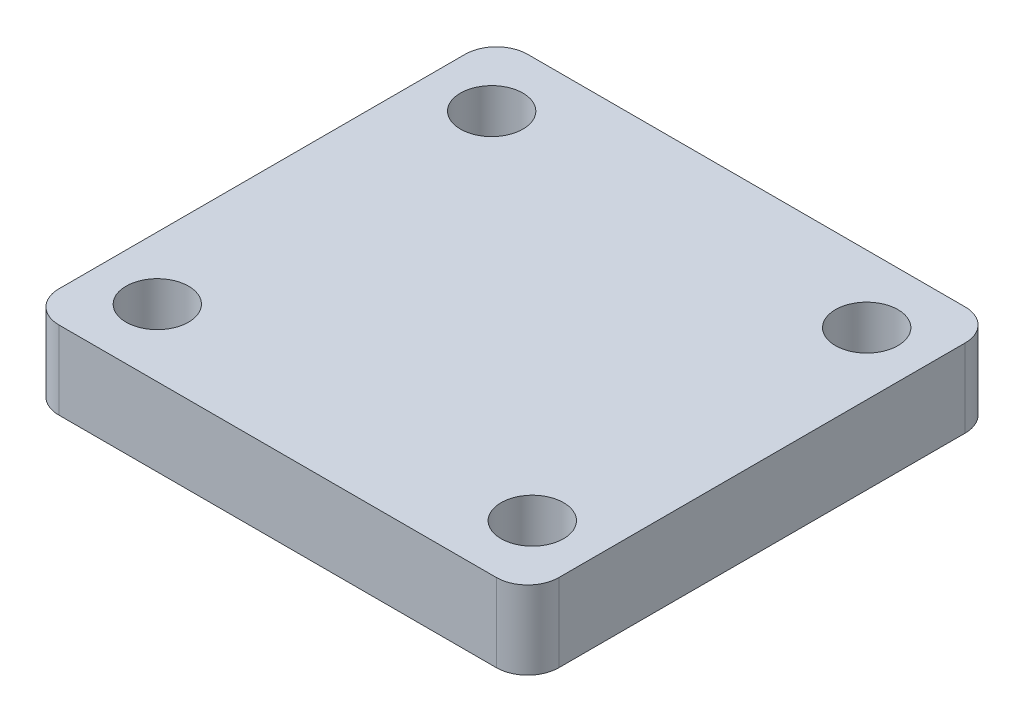
ISO-10303-21;
HEADER;
FILE_DESCRIPTION(('STEP AP214'),'2;1');
FILE_NAME('part.step','',(''),(''),'','','');
FILE_SCHEMA(('AUTOMOTIVE_DESIGN { 1 0 10303 214 1 1 1 1 }'));
ENDSEC;
DATA;
#1=APPLICATION_CONTEXT('core data for automotive mechanical design processes');
#2=APPLICATION_PROTOCOL_DEFINITION('international standard','automotive_design',2000,#1);
#3=PRODUCT_CONTEXT('',#1,'mechanical');
#4=PRODUCT('Part','Part','',(#3));
#5=PRODUCT_RELATED_PRODUCT_CATEGORY('part','',(#4));
#6=PRODUCT_DEFINITION_FORMATION('','',#4);
#7=PRODUCT_DEFINITION_CONTEXT('part definition',#1,'design');
#8=PRODUCT_DEFINITION('design','',#6,#7);
#9=PRODUCT_DEFINITION_SHAPE('','',#8);
#10=(LENGTH_UNIT() NAMED_UNIT(*) SI_UNIT(.MILLI.,.METRE.));
#11=(NAMED_UNIT(*) PLANE_ANGLE_UNIT() SI_UNIT($,.RADIAN.));
#12=(NAMED_UNIT(*) SI_UNIT($,.STERADIAN.) SOLID_ANGLE_UNIT());
#13=UNCERTAINTY_MEASURE_WITH_UNIT(LENGTH_MEASURE(1.E-05),#10,'distance_accuracy_value','');
#14=(GEOMETRIC_REPRESENTATION_CONTEXT(3) GLOBAL_UNCERTAINTY_ASSIGNED_CONTEXT((#13)) GLOBAL_UNIT_ASSIGNED_CONTEXT((#10,
#11,#12)) REPRESENTATION_CONTEXT('',''));
#15=CARTESIAN_POINT('',(0.,0.,0.));
#16=DIRECTION('',(0.,0.,1.));
#17=DIRECTION('',(1.,0.,0.));
#18=AXIS2_PLACEMENT_3D('',#15,#16,#17);
#19=CARTESIAN_POINT('',(-14.,5.,13.));
#20=DIRECTION('',(0.,-1.,0.));
#21=DIRECTION('',(0.,0.,-1.));
#22=AXIS2_PLACEMENT_3D('',#19,#20,#21);
#23=CYLINDRICAL_SURFACE('',#22,2.);
#24=CARTESIAN_POINT('',(-14.,0.,13.));
#25=DIRECTION('',(0.,1.,0.));
#26=DIRECTION('',(0.,0.,1.));
#27=AXIS2_PLACEMENT_3D('',#24,#25,#26);
#28=CIRCLE('',#27,2.);
#29=CARTESIAN_POINT('',(-16.,0.,13.));
#30=VERTEX_POINT('',#29);
#31=CARTESIAN_POINT('',(-14.,0.,15.));
#32=VERTEX_POINT('',#31);
#33=EDGE_CURVE('E128',#30,#32,#28,.T.);
#34=ORIENTED_EDGE('',*,*,#33,.T.);
#35=DIRECTION('',(0.,-1.,0.));
#36=VECTOR('',#35,1.);
#37=CARTESIAN_POINT('',(-14.,5.,15.));
#38=LINE('',#37,#36);
#39=CARTESIAN_POINT('',(-14.,5.,15.));
#40=VERTEX_POINT('',#39);
#41=EDGE_CURVE('E11',#40,#32,#38,.T.);
#42=ORIENTED_EDGE('',*,*,#41,.F.);
#43=CARTESIAN_POINT('',(-14.,5.,13.));
#44=DIRECTION('',(0.,1.,0.));
#45=DIRECTION('',(0.,0.,1.));
#46=AXIS2_PLACEMENT_3D('',#43,#44,#45);
#47=CIRCLE('',#46,2.);
#48=CARTESIAN_POINT('',(-16.,5.,13.));
#49=VERTEX_POINT('',#48);
#50=EDGE_CURVE('E143',#49,#40,#47,.T.);
#51=ORIENTED_EDGE('',*,*,#50,.F.);
#52=DIRECTION('',(0.,-1.,0.));
#53=VECTOR('',#52,1.);
#54=CARTESIAN_POINT('',(-16.,5.,13.));
#55=LINE('',#54,#53);
#56=EDGE_CURVE('E124',#49,#30,#55,.T.);
#57=ORIENTED_EDGE('',*,*,#56,.T.);
#58=EDGE_LOOP('',(#34,#42,#51,#57));
#59=FACE_BOUND('',#58,.T.);
#60=ADVANCED_FACE('F32',(#59),#23,.T.);
#61=CARTESIAN_POINT('',(14.,5.,15.));
#62=DIRECTION('',(0.,0.,-1.));
#63=DIRECTION('',(-1.,0.,0.));
#64=AXIS2_PLACEMENT_3D('',#61,#62,#63);
#65=PLANE('',#64);
#66=DIRECTION('',(1.,0.,0.));
#67=VECTOR('',#66,1.);
#68=CARTESIAN_POINT('',(14.,0.,15.));
#69=LINE('',#68,#67);
#70=CARTESIAN_POINT('',(14.,0.,15.));
#71=VERTEX_POINT('',#70);
#72=EDGE_CURVE('E131',#32,#71,#69,.T.);
#73=ORIENTED_EDGE('',*,*,#72,.T.);
#74=DIRECTION('',(0.,-1.,0.));
#75=VECTOR('',#74,1.);
#76=CARTESIAN_POINT('',(14.,5.,15.));
#77=LINE('',#76,#75);
#78=CARTESIAN_POINT('',(14.,5.,15.));
#79=VERTEX_POINT('',#78);
#80=EDGE_CURVE('E40',#79,#71,#77,.T.);
#81=ORIENTED_EDGE('',*,*,#80,.F.);
#82=DIRECTION('',(1.,0.,0.));
#83=VECTOR('',#82,1.);
#84=CARTESIAN_POINT('',(14.,5.,15.));
#85=LINE('',#84,#83);
#86=EDGE_CURVE('E91',#40,#79,#85,.T.);
#87=ORIENTED_EDGE('',*,*,#86,.F.);
#88=ORIENTED_EDGE('',*,*,#41,.T.);
#89=EDGE_LOOP('',(#73,#81,#87,#88));
#90=FACE_BOUND('',#89,.T.);
#91=ADVANCED_FACE('F228',(#90),#65,.F.);
#92=CARTESIAN_POINT('',(14.,5.,13.));
#93=DIRECTION('',(0.,-1.,0.));
#94=DIRECTION('',(0.,0.,-1.));
#95=AXIS2_PLACEMENT_3D('',#92,#93,#94);
#96=CYLINDRICAL_SURFACE('',#95,2.);
#97=CARTESIAN_POINT('',(14.,0.,13.));
#98=DIRECTION('',(0.,1.,0.));
#99=DIRECTION('',(0.,0.,-1.));
#100=AXIS2_PLACEMENT_3D('',#97,#98,#99);
#101=CIRCLE('',#100,2.);
#102=CARTESIAN_POINT('',(16.,0.,13.));
#103=VERTEX_POINT('',#102);
#104=EDGE_CURVE('E134',#71,#103,#101,.T.);
#105=ORIENTED_EDGE('',*,*,#104,.T.);
#106=DIRECTION('',(0.,-1.,0.));
#107=VECTOR('',#106,1.);
#108=CARTESIAN_POINT('',(16.,5.,13.));
#109=LINE('',#108,#107);
#110=CARTESIAN_POINT('',(16.,5.,13.));
#111=VERTEX_POINT('',#110);
#112=EDGE_CURVE('E150',#111,#103,#109,.T.);
#113=ORIENTED_EDGE('',*,*,#112,.F.);
#114=CARTESIAN_POINT('',(14.,5.,13.));
#115=DIRECTION('',(0.,1.,0.));
#116=DIRECTION('',(0.,0.,-1.));
#117=AXIS2_PLACEMENT_3D('',#114,#115,#116);
#118=CIRCLE('',#117,2.);
#119=EDGE_CURVE('E158',#79,#111,#118,.T.);
#120=ORIENTED_EDGE('',*,*,#119,.F.);
#121=ORIENTED_EDGE('',*,*,#80,.T.);
#122=EDGE_LOOP('',(#105,#113,#120,#121));
#123=FACE_BOUND('',#122,.T.);
#124=ADVANCED_FACE('F156',(#123),#96,.T.);
#125=CARTESIAN_POINT('',(16.,5.,13.));
#126=DIRECTION('',(-1.,0.,0.));
#127=DIRECTION('',(0.,0.,1.));
#128=AXIS2_PLACEMENT_3D('',#125,#126,#127);
#129=PLANE('',#128);
#130=DIRECTION('',(0.,0.,-1.));
#131=VECTOR('',#130,1.);
#132=CARTESIAN_POINT('',(16.,0.,13.));
#133=LINE('',#132,#131);
#134=CARTESIAN_POINT('',(16.,0.,-13.));
#135=VERTEX_POINT('',#134);
#136=EDGE_CURVE('E136',#103,#135,#133,.T.);
#137=ORIENTED_EDGE('',*,*,#136,.T.);
#138=DIRECTION('',(0.,-1.,0.));
#139=VECTOR('',#138,1.);
#140=CARTESIAN_POINT('',(16.,5.,-13.));
#141=LINE('',#140,#139);
#142=CARTESIAN_POINT('',(16.,5.,-13.));
#143=VERTEX_POINT('',#142);
#144=EDGE_CURVE('E147',#143,#135,#141,.T.);
#145=ORIENTED_EDGE('',*,*,#144,.F.);
#146=DIRECTION('',(0.,0.,-1.));
#147=VECTOR('',#146,1.);
#148=CARTESIAN_POINT('',(16.,5.,13.));
#149=LINE('',#148,#147);
#150=EDGE_CURVE('E170',#111,#143,#149,.T.);
#151=ORIENTED_EDGE('',*,*,#150,.F.);
#152=ORIENTED_EDGE('',*,*,#112,.T.);
#153=EDGE_LOOP('',(#137,#145,#151,#152));
#154=FACE_BOUND('',#153,.T.);
#155=ADVANCED_FACE('F166',(#154),#129,.F.);
#156=CARTESIAN_POINT('',(14.,5.,-13.));
#157=DIRECTION('',(0.,-1.,0.));
#158=DIRECTION('',(0.,0.,-1.));
#159=AXIS2_PLACEMENT_3D('',#156,#157,#158);
#160=CYLINDRICAL_SURFACE('',#159,2.);
#161=CARTESIAN_POINT('',(14.,0.,-13.));
#162=DIRECTION('',(0.,1.,0.));
#163=DIRECTION('',(0.,0.,1.));
#164=AXIS2_PLACEMENT_3D('',#161,#162,#163);
#165=CIRCLE('',#164,2.);
#166=CARTESIAN_POINT('',(14.,0.,-15.));
#167=VERTEX_POINT('',#166);
#168=EDGE_CURVE('E138',#135,#167,#165,.T.);
#169=ORIENTED_EDGE('',*,*,#168,.T.);
#170=DIRECTION('',(0.,-1.,0.));
#171=VECTOR('',#170,1.);
#172=CARTESIAN_POINT('',(14.,5.,-15.));
#173=LINE('',#172,#171);
#174=CARTESIAN_POINT('',(14.,5.,-15.));
#175=VERTEX_POINT('',#174);
#176=EDGE_CURVE('E119',#175,#167,#173,.T.);
#177=ORIENTED_EDGE('',*,*,#176,.F.);
#178=CARTESIAN_POINT('',(14.,5.,-13.));
#179=DIRECTION('',(0.,1.,0.));
#180=DIRECTION('',(0.,0.,1.));
#181=AXIS2_PLACEMENT_3D('',#178,#179,#180);
#182=CIRCLE('',#181,2.);
#183=EDGE_CURVE('E110',#143,#175,#182,.T.);
#184=ORIENTED_EDGE('',*,*,#183,.F.);
#185=ORIENTED_EDGE('',*,*,#144,.T.);
#186=EDGE_LOOP('',(#169,#177,#184,#185));
#187=FACE_BOUND('',#186,.T.);
#188=ADVANCED_FACE('F169',(#187),#160,.T.);
#189=CARTESIAN_POINT('',(14.,5.,-15.));
#190=DIRECTION('',(0.,0.,1.));
#191=DIRECTION('',(1.,0.,0.));
#192=AXIS2_PLACEMENT_3D('',#189,#190,#191);
#193=PLANE('',#192);
#194=DIRECTION('',(-1.,0.,0.));
#195=VECTOR('',#194,1.);
#196=CARTESIAN_POINT('',(14.,0.,-15.));
#197=LINE('',#196,#195);
#198=CARTESIAN_POINT('',(-14.,0.,-15.));
#199=VERTEX_POINT('',#198);
#200=EDGE_CURVE('E118',#167,#199,#197,.T.);
#201=ORIENTED_EDGE('',*,*,#200,.T.);
#202=DIRECTION('',(0.,-1.,0.));
#203=VECTOR('',#202,1.);
#204=CARTESIAN_POINT('',(-14.,5.,-15.));
#205=LINE('',#204,#203);
#206=CARTESIAN_POINT('',(-14.,5.,-15.));
#207=VERTEX_POINT('',#206);
#208=EDGE_CURVE('E115',#207,#199,#205,.T.);
#209=ORIENTED_EDGE('',*,*,#208,.F.);
#210=DIRECTION('',(-1.,0.,0.));
#211=VECTOR('',#210,1.);
#212=CARTESIAN_POINT('',(14.,5.,-15.));
#213=LINE('',#212,#211);
#214=EDGE_CURVE('E104',#175,#207,#213,.T.);
#215=ORIENTED_EDGE('',*,*,#214,.F.);
#216=ORIENTED_EDGE('',*,*,#176,.T.);
#217=EDGE_LOOP('',(#201,#209,#215,#216));
#218=FACE_BOUND('',#217,.T.);
#219=ADVANCED_FACE('F116',(#218),#193,.F.);
#220=CARTESIAN_POINT('',(-14.,5.,-13.));
#221=DIRECTION('',(0.,-1.,0.));
#222=DIRECTION('',(0.,0.,-1.));
#223=AXIS2_PLACEMENT_3D('',#220,#221,#222);
#224=CYLINDRICAL_SURFACE('',#223,2.);
#225=CARTESIAN_POINT('',(-14.,0.,-13.));
#226=DIRECTION('',(0.,1.,0.));
#227=DIRECTION('',(0.,0.,1.));
#228=AXIS2_PLACEMENT_3D('',#225,#226,#227);
#229=CIRCLE('',#228,2.);
#230=CARTESIAN_POINT('',(-16.,0.,-13.));
#231=VERTEX_POINT('',#230);
#232=EDGE_CURVE('E77',#199,#231,#229,.T.);
#233=ORIENTED_EDGE('',*,*,#232,.T.);
#234=DIRECTION('',(0.,-1.,0.));
#235=VECTOR('',#234,1.);
#236=CARTESIAN_POINT('',(-16.,5.,-13.));
#237=LINE('',#236,#235);
#238=CARTESIAN_POINT('',(-16.,5.,-13.));
#239=VERTEX_POINT('',#238);
#240=EDGE_CURVE('E120',#239,#231,#237,.T.);
#241=ORIENTED_EDGE('',*,*,#240,.F.);
#242=CARTESIAN_POINT('',(-14.,5.,-13.));
#243=DIRECTION('',(0.,1.,0.));
#244=DIRECTION('',(0.,0.,1.));
#245=AXIS2_PLACEMENT_3D('',#242,#243,#244);
#246=CIRCLE('',#245,2.);
#247=EDGE_CURVE('E108',#207,#239,#246,.T.);
#248=ORIENTED_EDGE('',*,*,#247,.F.);
#249=ORIENTED_EDGE('',*,*,#208,.T.);
#250=EDGE_LOOP('',(#233,#241,#248,#249));
#251=FACE_BOUND('',#250,.T.);
#252=ADVANCED_FACE('F122',(#251),#224,.T.);
#253=CARTESIAN_POINT('',(-16.,5.,13.));
#254=DIRECTION('',(1.,0.,0.));
#255=DIRECTION('',(0.,0.,-1.));
#256=AXIS2_PLACEMENT_3D('',#253,#254,#255);
#257=PLANE('',#256);
#258=DIRECTION('',(0.,0.,1.));
#259=VECTOR('',#258,1.);
#260=CARTESIAN_POINT('',(-16.,0.,13.));
#261=LINE('',#260,#259);
#262=EDGE_CURVE('E83',#231,#30,#261,.T.);
#263=ORIENTED_EDGE('',*,*,#262,.T.);
#264=ORIENTED_EDGE('',*,*,#56,.F.);
#265=DIRECTION('',(0.,0.,1.));
#266=VECTOR('',#265,1.);
#267=CARTESIAN_POINT('',(-16.,5.,13.));
#268=LINE('',#267,#266);
#269=EDGE_CURVE('E48',#239,#49,#268,.T.);
#270=ORIENTED_EDGE('',*,*,#269,.F.);
#271=ORIENTED_EDGE('',*,*,#240,.T.);
#272=EDGE_LOOP('',(#263,#264,#270,#271));
#273=FACE_BOUND('',#272,.T.);
#274=ADVANCED_FACE('F212',(#273),#257,.F.);
#275=CARTESIAN_POINT('',(-14.,5.,13.));
#276=DIRECTION('',(0.,1.,0.));
#277=DIRECTION('',(0.,0.,1.));
#278=AXIS2_PLACEMENT_3D('',#275,#276,#277);
#279=PLANE('',#278);
#280=CARTESIAN_POINT('',(-12.,5.,10.7));
#281=DIRECTION('',(0.,1.,0.));
#282=DIRECTION('',(0.,0.,-1.));
#283=AXIS2_PLACEMENT_3D('',#280,#281,#282);
#284=CIRCLE('',#283,2.);
#285=CARTESIAN_POINT('',(-12.,5.,8.7));
#286=VERTEX_POINT('',#285);
#287=EDGE_CURVE('E182',#286,#286,#284,.T.);
#288=ORIENTED_EDGE('',*,*,#287,.F.);
#289=EDGE_LOOP('',(#288));
#290=FACE_BOUND('',#289,.T.);
#291=CARTESIAN_POINT('',(12.,5.,10.7));
#292=DIRECTION('',(0.,1.,0.));
#293=DIRECTION('',(0.,0.,1.));
#294=AXIS2_PLACEMENT_3D('',#291,#292,#293);
#295=CIRCLE('',#294,2.);
#296=CARTESIAN_POINT('',(12.,5.,12.7));
#297=VERTEX_POINT('',#296);
#298=EDGE_CURVE('E188',#297,#297,#295,.T.);
#299=ORIENTED_EDGE('',*,*,#298,.F.);
#300=EDGE_LOOP('',(#299));
#301=FACE_BOUND('',#300,.T.);
#302=CARTESIAN_POINT('',(12.,5.,-10.7));
#303=DIRECTION('',(0.,1.,0.));
#304=DIRECTION('',(0.,0.,-1.));
#305=AXIS2_PLACEMENT_3D('',#302,#303,#304);
#306=CIRCLE('',#305,2.);
#307=CARTESIAN_POINT('',(12.,5.,-12.7));
#308=VERTEX_POINT('',#307);
#309=EDGE_CURVE('E194',#308,#308,#306,.T.);
#310=ORIENTED_EDGE('',*,*,#309,.F.);
#311=EDGE_LOOP('',(#310));
#312=FACE_BOUND('',#311,.T.);
#313=CARTESIAN_POINT('',(-12.,5.,-10.7));
#314=DIRECTION('',(0.,1.,0.));
#315=DIRECTION('',(0.,0.,1.));
#316=AXIS2_PLACEMENT_3D('',#313,#314,#315);
#317=CIRCLE('',#316,2.);
#318=CARTESIAN_POINT('',(-12.,5.,-8.7));
#319=VERTEX_POINT('',#318);
#320=EDGE_CURVE('E176',#319,#319,#317,.T.);
#321=ORIENTED_EDGE('',*,*,#320,.F.);
#322=EDGE_LOOP('',(#321));
#323=FACE_BOUND('',#322,.T.);
#324=ORIENTED_EDGE('',*,*,#50,.T.);
#325=ORIENTED_EDGE('',*,*,#86,.T.);
#326=ORIENTED_EDGE('',*,*,#119,.T.);
#327=ORIENTED_EDGE('',*,*,#150,.T.);
#328=ORIENTED_EDGE('',*,*,#183,.T.);
#329=ORIENTED_EDGE('',*,*,#214,.T.);
#330=ORIENTED_EDGE('',*,*,#247,.T.);
#331=ORIENTED_EDGE('',*,*,#269,.T.);
#332=EDGE_LOOP('',(#324,#325,#326,#327,#328,#329,#330,#331));
#333=FACE_BOUND('',#332,.T.);
#334=ADVANCED_FACE('F106',(#290,#301,#312,#323,#333),#279,.T.);
#335=CARTESIAN_POINT('',(-14.,0.,13.));
#336=DIRECTION('',(0.,1.,0.));
#337=DIRECTION('',(0.,0.,1.));
#338=AXIS2_PLACEMENT_3D('',#335,#336,#337);
#339=PLANE('',#338);
#340=CARTESIAN_POINT('',(-12.,0.,10.7));
#341=DIRECTION('',(0.,1.,0.));
#342=DIRECTION('',(0.,0.,-1.));
#343=AXIS2_PLACEMENT_3D('',#340,#341,#342);
#344=CIRCLE('',#343,2.);
#345=CARTESIAN_POINT('',(-12.,0.,8.7));
#346=VERTEX_POINT('',#345);
#347=EDGE_CURVE('E185',#346,#346,#344,.T.);
#348=ORIENTED_EDGE('',*,*,#347,.T.);
#349=EDGE_LOOP('',(#348));
#350=FACE_BOUND('',#349,.T.);
#351=CARTESIAN_POINT('',(12.,0.,10.7));
#352=DIRECTION('',(0.,1.,0.));
#353=DIRECTION('',(0.,0.,1.));
#354=AXIS2_PLACEMENT_3D('',#351,#352,#353);
#355=CIRCLE('',#354,2.);
#356=CARTESIAN_POINT('',(12.,0.,12.7));
#357=VERTEX_POINT('',#356);
#358=EDGE_CURVE('E191',#357,#357,#355,.T.);
#359=ORIENTED_EDGE('',*,*,#358,.T.);
#360=EDGE_LOOP('',(#359));
#361=FACE_BOUND('',#360,.T.);
#362=CARTESIAN_POINT('',(12.,0.,-10.7));
#363=DIRECTION('',(0.,1.,0.));
#364=DIRECTION('',(0.,0.,-1.));
#365=AXIS2_PLACEMENT_3D('',#362,#363,#364);
#366=CIRCLE('',#365,2.);
#367=CARTESIAN_POINT('',(12.,0.,-12.7));
#368=VERTEX_POINT('',#367);
#369=EDGE_CURVE('E179',#368,#368,#366,.T.);
#370=ORIENTED_EDGE('',*,*,#369,.T.);
#371=EDGE_LOOP('',(#370));
#372=FACE_BOUND('',#371,.T.);
#373=CARTESIAN_POINT('',(-12.,0.,-10.7));
#374=DIRECTION('',(0.,1.,0.));
#375=DIRECTION('',(0.,0.,1.));
#376=AXIS2_PLACEMENT_3D('',#373,#374,#375);
#377=CIRCLE('',#376,2.);
#378=CARTESIAN_POINT('',(-12.,0.,-8.7));
#379=VERTEX_POINT('',#378);
#380=EDGE_CURVE('E132',#379,#379,#377,.T.);
#381=ORIENTED_EDGE('',*,*,#380,.T.);
#382=EDGE_LOOP('',(#381));
#383=FACE_BOUND('',#382,.T.);
#384=ORIENTED_EDGE('',*,*,#33,.F.);
#385=ORIENTED_EDGE('',*,*,#262,.F.);
#386=ORIENTED_EDGE('',*,*,#232,.F.);
#387=ORIENTED_EDGE('',*,*,#200,.F.);
#388=ORIENTED_EDGE('',*,*,#168,.F.);
#389=ORIENTED_EDGE('',*,*,#136,.F.);
#390=ORIENTED_EDGE('',*,*,#104,.F.);
#391=ORIENTED_EDGE('',*,*,#72,.F.);
#392=EDGE_LOOP('',(#384,#385,#386,#387,#388,#389,#390,#391));
#393=FACE_BOUND('',#392,.T.);
#394=ADVANCED_FACE('F162',(#350,#361,#372,#383,#393),#339,.F.);
#395=CARTESIAN_POINT('',(-12.,0.,-10.7));
#396=DIRECTION('',(0.,1.,0.));
#397=DIRECTION('',(0.,0.,1.));
#398=AXIS2_PLACEMENT_3D('',#395,#396,#397);
#399=CYLINDRICAL_SURFACE('',#398,2.);
#400=ORIENTED_EDGE('',*,*,#380,.F.);
#401=EDGE_LOOP('',(#400));
#402=FACE_BOUND('',#401,.T.);
#403=ORIENTED_EDGE('',*,*,#320,.T.);
#404=EDGE_LOOP('',(#403));
#405=FACE_BOUND('',#404,.T.);
#406=ADVANCED_FACE('F206',(#402,#405),#399,.F.);
#407=CARTESIAN_POINT('',(12.,0.,-10.7));
#408=DIRECTION('',(0.,1.,0.));
#409=DIRECTION('',(0.,0.,1.));
#410=AXIS2_PLACEMENT_3D('',#407,#408,#409);
#411=CYLINDRICAL_SURFACE('',#410,2.);
#412=ORIENTED_EDGE('',*,*,#369,.F.);
#413=EDGE_LOOP('',(#412));
#414=FACE_BOUND('',#413,.T.);
#415=ORIENTED_EDGE('',*,*,#309,.T.);
#416=EDGE_LOOP('',(#415));
#417=FACE_BOUND('',#416,.T.);
#418=ADVANCED_FACE('F202',(#414,#417),#411,.F.);
#419=CARTESIAN_POINT('',(12.,0.,10.7));
#420=DIRECTION('',(0.,1.,0.));
#421=DIRECTION('',(0.,0.,1.));
#422=AXIS2_PLACEMENT_3D('',#419,#420,#421);
#423=CYLINDRICAL_SURFACE('',#422,2.);
#424=ORIENTED_EDGE('',*,*,#358,.F.);
#425=EDGE_LOOP('',(#424));
#426=FACE_BOUND('',#425,.T.);
#427=ORIENTED_EDGE('',*,*,#298,.T.);
#428=EDGE_LOOP('',(#427));
#429=FACE_BOUND('',#428,.T.);
#430=ADVANCED_FACE('F205',(#426,#429),#423,.F.);
#431=CARTESIAN_POINT('',(-12.,0.,10.7));
#432=DIRECTION('',(0.,1.,0.));
#433=DIRECTION('',(0.,0.,1.));
#434=AXIS2_PLACEMENT_3D('',#431,#432,#433);
#435=CYLINDRICAL_SURFACE('',#434,2.);
#436=ORIENTED_EDGE('',*,*,#347,.F.);
#437=EDGE_LOOP('',(#436));
#438=FACE_BOUND('',#437,.T.);
#439=ORIENTED_EDGE('',*,*,#287,.T.);
#440=EDGE_LOOP('',(#439));
#441=FACE_BOUND('',#440,.T.);
#442=ADVANCED_FACE('F304',(#438,#441),#435,.F.);
#443=CLOSED_SHELL('',(#60,#91,#124,#155,#188,#219,#252,#274,#334,#394,#406,#418,#430,#442));
#444=MANIFOLD_SOLID_BREP('B2',#443);
#445=ADVANCED_BREP_SHAPE_REPRESENTATION('',(#18,#444),#14);
#446=SHAPE_DEFINITION_REPRESENTATION(#9,#445);
ENDSEC;
END-ISO-10303-21;
